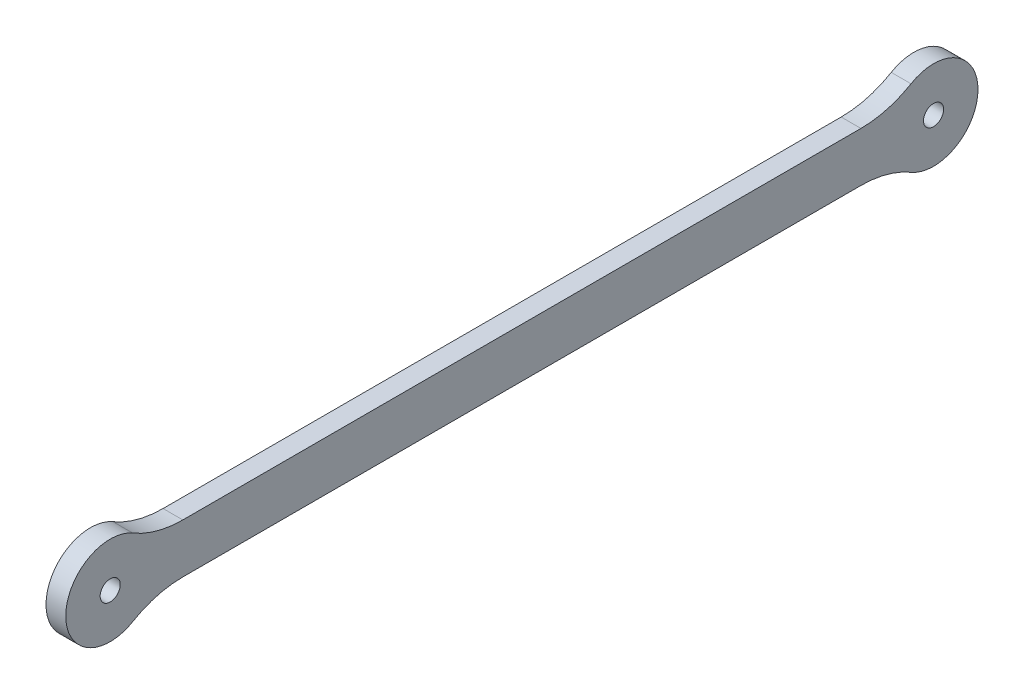
ISO-10303-21;
HEADER;
FILE_DESCRIPTION(('STEP AP214'),'2;1');
FILE_NAME('part.step','',(''),(''),'','','');
FILE_SCHEMA(('AUTOMOTIVE_DESIGN { 1 0 10303 214 1 1 1 1 }'));
ENDSEC;
DATA;
#1=APPLICATION_CONTEXT('core data for automotive mechanical design processes');
#2=APPLICATION_PROTOCOL_DEFINITION('international standard','automotive_design',2000,#1);
#3=PRODUCT_CONTEXT('',#1,'mechanical');
#4=PRODUCT('Part','Part','',(#3));
#5=PRODUCT_RELATED_PRODUCT_CATEGORY('part','',(#4));
#6=PRODUCT_DEFINITION_FORMATION('','',#4);
#7=PRODUCT_DEFINITION_CONTEXT('part definition',#1,'design');
#8=PRODUCT_DEFINITION('design','',#6,#7);
#9=PRODUCT_DEFINITION_SHAPE('','',#8);
#10=(LENGTH_UNIT() NAMED_UNIT(*) SI_UNIT(.MILLI.,.METRE.));
#11=(NAMED_UNIT(*) PLANE_ANGLE_UNIT() SI_UNIT($,.RADIAN.));
#12=(NAMED_UNIT(*) SI_UNIT($,.STERADIAN.) SOLID_ANGLE_UNIT());
#13=UNCERTAINTY_MEASURE_WITH_UNIT(LENGTH_MEASURE(1.E-05),#10,'distance_accuracy_value','');
#14=(GEOMETRIC_REPRESENTATION_CONTEXT(3) GLOBAL_UNCERTAINTY_ASSIGNED_CONTEXT((#13)) GLOBAL_UNIT_ASSIGNED_CONTEXT((#10,
#11,#12)) REPRESENTATION_CONTEXT('',''));
#15=CARTESIAN_POINT('',(0.,0.,0.));
#16=DIRECTION('',(0.,0.,1.));
#17=DIRECTION('',(1.,0.,0.));
#18=AXIS2_PLACEMENT_3D('',#15,#16,#17);
#19=CARTESIAN_POINT('',(1.5,0.,0.));
#20=DIRECTION('',(1.,0.,0.));
#21=DIRECTION('',(0.,0.,-1.));
#22=AXIS2_PLACEMENT_3D('',#19,#20,#21);
#23=PLANE('',#22);
#24=CARTESIAN_POINT('',(1.5,0.,-62.5));
#25=DIRECTION('',(-1.,0.,0.));
#26=DIRECTION('',(0.,0.,1.));
#27=AXIS2_PLACEMENT_3D('',#24,#25,#26);
#28=CIRCLE('',#27,1.52500000000001);
#29=CARTESIAN_POINT('',(1.5,0.,-60.975));
#30=VERTEX_POINT('',#29);
#31=EDGE_CURVE('E96',#30,#30,#28,.T.);
#32=ORIENTED_EDGE('',*,*,#31,.T.);
#33=EDGE_LOOP('',(#32));
#34=FACE_BOUND('',#33,.T.);
#35=CARTESIAN_POINT('',(1.5,0.,62.5));
#36=DIRECTION('',(-1.,0.,0.));
#37=DIRECTION('',(0.,0.,1.));
#38=AXIS2_PLACEMENT_3D('',#35,#36,#37);
#39=CIRCLE('',#38,1.52499999999999);
#40=CARTESIAN_POINT('',(1.5,0.,64.025));
#41=VERTEX_POINT('',#40);
#42=EDGE_CURVE('E93',#41,#41,#39,.T.);
#43=ORIENTED_EDGE('',*,*,#42,.T.);
#44=EDGE_LOOP('',(#43));
#45=FACE_BOUND('',#44,.T.);
#46=DIRECTION('',(0.,0.,-1.));
#47=VECTOR('',#46,1.);
#48=CARTESIAN_POINT('',(1.5,-3.75,0.));
#49=LINE('',#48,#47);
#50=CARTESIAN_POINT('',(1.5,-3.74999999999999,-51.4772961574757));
#51=VERTEX_POINT('',#50);
#52=CARTESIAN_POINT('',(1.5,-3.75000000000001,51.4772961574757));
#53=VERTEX_POINT('',#52);
#54=EDGE_CURVE('E102',#51,#53,#49,.F.);
#55=ORIENTED_EDGE('',*,*,#54,.F.);
#56=CARTESIAN_POINT('',(1.5,-18.75,-51.4772961574757));
#57=DIRECTION('',(-1.,0.,0.));
#58=DIRECTION('',(0.,0.,1.));
#59=AXIS2_PLACEMENT_3D('',#56,#57,#58);
#60=CIRCLE('',#59,15.);
#61=CARTESIAN_POINT('',(1.5,-5.81896551724137,-59.079160876458));
#62=VERTEX_POINT('',#61);
#63=EDGE_CURVE('E132',#51,#62,#60,.T.);
#64=ORIENTED_EDGE('',*,*,#63,.T.);
#65=CARTESIAN_POINT('',(1.5,0.,-62.5));
#66=DIRECTION('',(-1.,0.,0.));
#67=DIRECTION('',(0.,0.,1.));
#68=AXIS2_PLACEMENT_3D('',#65,#66,#67);
#69=CIRCLE('',#68,6.74999999999999);
#70=CARTESIAN_POINT('',(1.5,5.81896551724138,-59.079160876458));
#71=VERTEX_POINT('',#70);
#72=EDGE_CURVE('E129',#71,#62,#69,.T.);
#73=ORIENTED_EDGE('',*,*,#72,.F.);
#74=CARTESIAN_POINT('',(1.5,18.75,-51.4772961574757));
#75=DIRECTION('',(-1.,0.,0.));
#76=DIRECTION('',(0.,0.,1.));
#77=AXIS2_PLACEMENT_3D('',#74,#75,#76);
#78=CIRCLE('',#77,15.);
#79=CARTESIAN_POINT('',(1.5,3.75000000000001,-51.4772961574757));
#80=VERTEX_POINT('',#79);
#81=EDGE_CURVE('E90',#71,#80,#78,.T.);
#82=ORIENTED_EDGE('',*,*,#81,.T.);
#83=DIRECTION('',(0.,0.,-1.));
#84=VECTOR('',#83,1.);
#85=CARTESIAN_POINT('',(1.5,3.75,0.));
#86=LINE('',#85,#84);
#87=CARTESIAN_POINT('',(1.5,3.74999999999999,51.4772961574757));
#88=VERTEX_POINT('',#87);
#89=EDGE_CURVE('E88',#80,#88,#86,.F.);
#90=ORIENTED_EDGE('',*,*,#89,.T.);
#91=CARTESIAN_POINT('',(1.5,18.75,51.4772961574757));
#92=DIRECTION('',(-1.,0.,0.));
#93=DIRECTION('',(0.,0.,1.));
#94=AXIS2_PLACEMENT_3D('',#91,#92,#93);
#95=CIRCLE('',#94,15.);
#96=CARTESIAN_POINT('',(1.5,5.81896551724137,59.079160876458));
#97=VERTEX_POINT('',#96);
#98=EDGE_CURVE('E19',#88,#97,#95,.T.);
#99=ORIENTED_EDGE('',*,*,#98,.T.);
#100=CARTESIAN_POINT('',(1.5,0.,62.5));
#101=DIRECTION('',(-1.,0.,0.));
#102=DIRECTION('',(0.,0.,1.));
#103=AXIS2_PLACEMENT_3D('',#100,#101,#102);
#104=CIRCLE('',#103,6.75);
#105=CARTESIAN_POINT('',(1.5,-5.81896551724139,59.079160876458));
#106=VERTEX_POINT('',#105);
#107=EDGE_CURVE('E138',#106,#97,#104,.T.);
#108=ORIENTED_EDGE('',*,*,#107,.F.);
#109=CARTESIAN_POINT('',(1.5,-18.75,51.4772961574757));
#110=DIRECTION('',(-1.,0.,0.));
#111=DIRECTION('',(0.,0.,1.));
#112=AXIS2_PLACEMENT_3D('',#109,#110,#111);
#113=CIRCLE('',#112,15.);
#114=EDGE_CURVE('E104',#106,#53,#113,.T.);
#115=ORIENTED_EDGE('',*,*,#114,.T.);
#116=EDGE_LOOP('',(#55,#64,#73,#82,#90,#99,#108,#115));
#117=FACE_BOUND('',#116,.T.);
#118=ADVANCED_FACE('F16',(#34,#45,#117),#23,.T.);
#119=CARTESIAN_POINT('',(1.5,18.75,51.4772961574757));
#120=DIRECTION('',(-1.,0.,0.));
#121=DIRECTION('',(0.,0.,1.));
#122=AXIS2_PLACEMENT_3D('',#119,#120,#121);
#123=CYLINDRICAL_SURFACE('',#122,15.);
#124=DIRECTION('',(1.,0.,0.));
#125=VECTOR('',#124,1.);
#126=CARTESIAN_POINT('',(1.5,3.74999999999999,51.4772961574757));
#127=LINE('',#126,#125);
#128=CARTESIAN_POINT('',(-1.5,3.75,51.4772961574757));
#129=VERTEX_POINT('',#128);
#130=EDGE_CURVE('E83',#88,#129,#127,.F.);
#131=ORIENTED_EDGE('',*,*,#130,.T.);
#132=CARTESIAN_POINT('',(-1.5,18.75,51.4772961574757));
#133=DIRECTION('',(-1.,0.,0.));
#134=DIRECTION('',(0.,0.,1.));
#135=AXIS2_PLACEMENT_3D('',#132,#133,#134);
#136=CIRCLE('',#135,15.);
#137=CARTESIAN_POINT('',(-1.5,5.81896551724137,59.079160876458));
#138=VERTEX_POINT('',#137);
#139=EDGE_CURVE('E123',#129,#138,#136,.T.);
#140=ORIENTED_EDGE('',*,*,#139,.T.);
#141=DIRECTION('',(-1.,0.,0.));
#142=VECTOR('',#141,1.);
#143=CARTESIAN_POINT('',(1.5,5.81896551724137,59.079160876458));
#144=LINE('',#143,#142);
#145=EDGE_CURVE('E84',#97,#138,#144,.T.);
#146=ORIENTED_EDGE('',*,*,#145,.F.);
#147=ORIENTED_EDGE('',*,*,#98,.F.);
#148=EDGE_LOOP('',(#131,#140,#146,#147));
#149=FACE_BOUND('',#148,.T.);
#150=ADVANCED_FACE('F81',(#149),#123,.F.);
#151=CARTESIAN_POINT('',(1.5,0.,62.5));
#152=DIRECTION('',(-1.,0.,0.));
#153=DIRECTION('',(0.,0.,1.));
#154=AXIS2_PLACEMENT_3D('',#151,#152,#153);
#155=CYLINDRICAL_SURFACE('',#154,6.75);
#156=CARTESIAN_POINT('',(-1.5,0.,62.5));
#157=DIRECTION('',(-1.,0.,0.));
#158=DIRECTION('',(0.,0.,1.));
#159=AXIS2_PLACEMENT_3D('',#156,#157,#158);
#160=CIRCLE('',#159,6.75);
#161=CARTESIAN_POINT('',(-1.5,-5.81896551724139,59.079160876458));
#162=VERTEX_POINT('',#161);
#163=EDGE_CURVE('E121',#138,#162,#160,.F.);
#164=ORIENTED_EDGE('',*,*,#163,.T.);
#165=DIRECTION('',(-1.,0.,0.));
#166=VECTOR('',#165,1.);
#167=CARTESIAN_POINT('',(1.5,-5.81896551724139,59.079160876458));
#168=LINE('',#167,#166);
#169=EDGE_CURVE('E137',#162,#106,#168,.F.);
#170=ORIENTED_EDGE('',*,*,#169,.T.);
#171=ORIENTED_EDGE('',*,*,#107,.T.);
#172=ORIENTED_EDGE('',*,*,#145,.T.);
#173=EDGE_LOOP('',(#164,#170,#171,#172));
#174=FACE_BOUND('',#173,.T.);
#175=ADVANCED_FACE('F143',(#174),#155,.T.);
#176=CARTESIAN_POINT('',(1.5,-18.75,51.4772961574757));
#177=DIRECTION('',(-1.,0.,0.));
#178=DIRECTION('',(0.,0.,1.));
#179=AXIS2_PLACEMENT_3D('',#176,#177,#178);
#180=CYLINDRICAL_SURFACE('',#179,15.);
#181=ORIENTED_EDGE('',*,*,#169,.F.);
#182=CARTESIAN_POINT('',(-1.5,-18.75,51.4772961574757));
#183=DIRECTION('',(-1.,0.,0.));
#184=DIRECTION('',(0.,0.,1.));
#185=AXIS2_PLACEMENT_3D('',#182,#183,#184);
#186=CIRCLE('',#185,15.);
#187=CARTESIAN_POINT('',(-1.5,-3.75000000000001,51.4772961574757));
#188=VERTEX_POINT('',#187);
#189=EDGE_CURVE('E118',#162,#188,#186,.T.);
#190=ORIENTED_EDGE('',*,*,#189,.T.);
#191=DIRECTION('',(1.,0.,0.));
#192=VECTOR('',#191,1.);
#193=CARTESIAN_POINT('',(1.5,-3.75000000000001,51.4772961574757));
#194=LINE('',#193,#192);
#195=EDGE_CURVE('E103',#53,#188,#194,.F.);
#196=ORIENTED_EDGE('',*,*,#195,.F.);
#197=ORIENTED_EDGE('',*,*,#114,.F.);
#198=EDGE_LOOP('',(#181,#190,#196,#197));
#199=FACE_BOUND('',#198,.T.);
#200=ADVANCED_FACE('F154',(#199),#180,.F.);
#201=CARTESIAN_POINT('',(1.5,-3.75,0.));
#202=DIRECTION('',(0.,-1.,0.));
#203=DIRECTION('',(0.,0.,-1.));
#204=AXIS2_PLACEMENT_3D('',#201,#202,#203);
#205=PLANE('',#204);
#206=ORIENTED_EDGE('',*,*,#54,.T.);
#207=ORIENTED_EDGE('',*,*,#195,.T.);
#208=DIRECTION('',(0.,0.,-1.));
#209=VECTOR('',#208,1.);
#210=CARTESIAN_POINT('',(-1.5,-3.75000000000001,0.));
#211=LINE('',#210,#209);
#212=CARTESIAN_POINT('',(-1.5,-3.75,-51.4772961574757));
#213=VERTEX_POINT('',#212);
#214=EDGE_CURVE('E117',#188,#213,#211,.T.);
#215=ORIENTED_EDGE('',*,*,#214,.T.);
#216=DIRECTION('',(-1.,0.,0.));
#217=VECTOR('',#216,1.);
#218=CARTESIAN_POINT('',(1.5,-3.74999999999999,-51.4772961574757));
#219=LINE('',#218,#217);
#220=EDGE_CURVE('E135',#213,#51,#219,.F.);
#221=ORIENTED_EDGE('',*,*,#220,.T.);
#222=EDGE_LOOP('',(#206,#207,#215,#221));
#223=FACE_BOUND('',#222,.T.);
#224=ADVANCED_FACE('F162',(#223),#205,.T.);
#225=CARTESIAN_POINT('',(1.5,-18.75,-51.4772961574757));
#226=DIRECTION('',(-1.,0.,0.));
#227=DIRECTION('',(0.,0.,1.));
#228=AXIS2_PLACEMENT_3D('',#225,#226,#227);
#229=CYLINDRICAL_SURFACE('',#228,15.);
#230=ORIENTED_EDGE('',*,*,#220,.F.);
#231=CARTESIAN_POINT('',(-1.5,-18.75,-51.4772961574757));
#232=DIRECTION('',(-1.,0.,0.));
#233=DIRECTION('',(0.,0.,1.));
#234=AXIS2_PLACEMENT_3D('',#231,#232,#233);
#235=CIRCLE('',#234,15.);
#236=CARTESIAN_POINT('',(-1.5,-5.81896551724137,-59.079160876458));
#237=VERTEX_POINT('',#236);
#238=EDGE_CURVE('E114',#213,#237,#235,.T.);
#239=ORIENTED_EDGE('',*,*,#238,.T.);
#240=DIRECTION('',(-1.,0.,0.));
#241=VECTOR('',#240,1.);
#242=CARTESIAN_POINT('',(1.5,-5.81896551724137,-59.079160876458));
#243=LINE('',#242,#241);
#244=EDGE_CURVE('E131',#62,#237,#243,.T.);
#245=ORIENTED_EDGE('',*,*,#244,.F.);
#246=ORIENTED_EDGE('',*,*,#63,.F.);
#247=EDGE_LOOP('',(#230,#239,#245,#246));
#248=FACE_BOUND('',#247,.T.);
#249=ADVANCED_FACE('F161',(#248),#229,.F.);
#250=CARTESIAN_POINT('',(1.5,0.,-62.5));
#251=DIRECTION('',(-1.,0.,0.));
#252=DIRECTION('',(0.,0.,1.));
#253=AXIS2_PLACEMENT_3D('',#250,#251,#252);
#254=CYLINDRICAL_SURFACE('',#253,6.74999999999999);
#255=ORIENTED_EDGE('',*,*,#72,.T.);
#256=ORIENTED_EDGE('',*,*,#244,.T.);
#257=CARTESIAN_POINT('',(-1.5,0.,-62.5));
#258=DIRECTION('',(-1.,0.,0.));
#259=DIRECTION('',(0.,0.,1.));
#260=AXIS2_PLACEMENT_3D('',#257,#258,#259);
#261=CIRCLE('',#260,6.74999999999999);
#262=CARTESIAN_POINT('',(-1.5,5.81896551724138,-59.079160876458));
#263=VERTEX_POINT('',#262);
#264=EDGE_CURVE('E111',#237,#263,#261,.F.);
#265=ORIENTED_EDGE('',*,*,#264,.T.);
#266=DIRECTION('',(-1.,0.,0.));
#267=VECTOR('',#266,1.);
#268=CARTESIAN_POINT('',(1.5,5.81896551724138,-59.079160876458));
#269=LINE('',#268,#267);
#270=EDGE_CURVE('E128',#263,#71,#269,.F.);
#271=ORIENTED_EDGE('',*,*,#270,.T.);
#272=EDGE_LOOP('',(#255,#256,#265,#271));
#273=FACE_BOUND('',#272,.T.);
#274=ADVANCED_FACE('F171',(#273),#254,.T.);
#275=CARTESIAN_POINT('',(1.5,18.75,-51.4772961574757));
#276=DIRECTION('',(-1.,0.,0.));
#277=DIRECTION('',(0.,0.,1.));
#278=AXIS2_PLACEMENT_3D('',#275,#276,#277);
#279=CYLINDRICAL_SURFACE('',#278,15.);
#280=ORIENTED_EDGE('',*,*,#270,.F.);
#281=CARTESIAN_POINT('',(-1.5,18.75,-51.4772961574757));
#282=DIRECTION('',(-1.,0.,0.));
#283=DIRECTION('',(0.,0.,1.));
#284=AXIS2_PLACEMENT_3D('',#281,#282,#283);
#285=CIRCLE('',#284,15.);
#286=CARTESIAN_POINT('',(-1.5,3.75000000000001,-51.4772961574757));
#287=VERTEX_POINT('',#286);
#288=EDGE_CURVE('E108',#263,#287,#285,.T.);
#289=ORIENTED_EDGE('',*,*,#288,.T.);
#290=DIRECTION('',(1.,0.,0.));
#291=VECTOR('',#290,1.);
#292=CARTESIAN_POINT('',(1.5,3.75000000000001,-51.4772961574757));
#293=LINE('',#292,#291);
#294=EDGE_CURVE('E34',#287,#80,#293,.T.);
#295=ORIENTED_EDGE('',*,*,#294,.T.);
#296=ORIENTED_EDGE('',*,*,#81,.F.);
#297=EDGE_LOOP('',(#280,#289,#295,#296));
#298=FACE_BOUND('',#297,.T.);
#299=ADVANCED_FACE('F174',(#298),#279,.F.);
#300=CARTESIAN_POINT('',(1.5,3.75,0.));
#301=DIRECTION('',(0.,-1.,0.));
#302=DIRECTION('',(0.,0.,-1.));
#303=AXIS2_PLACEMENT_3D('',#300,#301,#302);
#304=PLANE('',#303);
#305=ORIENTED_EDGE('',*,*,#294,.F.);
#306=DIRECTION('',(0.,0.,-1.));
#307=VECTOR('',#306,1.);
#308=CARTESIAN_POINT('',(-1.5,3.75000000000001,0.));
#309=LINE('',#308,#307);
#310=EDGE_CURVE('E89',#287,#129,#309,.F.);
#311=ORIENTED_EDGE('',*,*,#310,.T.);
#312=ORIENTED_EDGE('',*,*,#130,.F.);
#313=ORIENTED_EDGE('',*,*,#89,.F.);
#314=EDGE_LOOP('',(#305,#311,#312,#313));
#315=FACE_BOUND('',#314,.T.);
#316=ADVANCED_FACE('F87',(#315),#304,.F.);
#317=CARTESIAN_POINT('',(1.5,0.,62.5));
#318=DIRECTION('',(-1.,0.,0.));
#319=DIRECTION('',(0.,0.,1.));
#320=AXIS2_PLACEMENT_3D('',#317,#318,#319);
#321=CYLINDRICAL_SURFACE('',#320,1.52499999999999);
#322=CARTESIAN_POINT('',(-1.5,0.,62.5));
#323=DIRECTION('',(-1.,0.,0.));
#324=DIRECTION('',(0.,0.,1.));
#325=AXIS2_PLACEMENT_3D('',#322,#323,#324);
#326=CIRCLE('',#325,1.52499999999999);
#327=CARTESIAN_POINT('',(-1.5,0.,64.025));
#328=VERTEX_POINT('',#327);
#329=EDGE_CURVE('E25',#328,#328,#326,.T.);
#330=ORIENTED_EDGE('',*,*,#329,.T.);
#331=EDGE_LOOP('',(#330));
#332=FACE_BOUND('',#331,.T.);
#333=ORIENTED_EDGE('',*,*,#42,.F.);
#334=EDGE_LOOP('',(#333));
#335=FACE_BOUND('',#334,.T.);
#336=ADVANCED_FACE('F182',(#332,#335),#321,.F.);
#337=CARTESIAN_POINT('',(1.5,0.,-62.5));
#338=DIRECTION('',(-1.,0.,0.));
#339=DIRECTION('',(0.,0.,1.));
#340=AXIS2_PLACEMENT_3D('',#337,#338,#339);
#341=CYLINDRICAL_SURFACE('',#340,1.52500000000001);
#342=CARTESIAN_POINT('',(-1.5,0.,-62.5));
#343=DIRECTION('',(-1.,0.,0.));
#344=DIRECTION('',(0.,0.,1.));
#345=AXIS2_PLACEMENT_3D('',#342,#343,#344);
#346=CIRCLE('',#345,1.52500000000001);
#347=CARTESIAN_POINT('',(-1.5,0.,-60.975));
#348=VERTEX_POINT('',#347);
#349=EDGE_CURVE('E11',#348,#348,#346,.T.);
#350=ORIENTED_EDGE('',*,*,#349,.T.);
#351=EDGE_LOOP('',(#350));
#352=FACE_BOUND('',#351,.T.);
#353=ORIENTED_EDGE('',*,*,#31,.F.);
#354=EDGE_LOOP('',(#353));
#355=FACE_BOUND('',#354,.T.);
#356=ADVANCED_FACE('F186',(#352,#355),#341,.F.);
#357=CARTESIAN_POINT('',(-1.5,0.,0.));
#358=DIRECTION('',(1.,0.,0.));
#359=DIRECTION('',(0.,0.,-1.));
#360=AXIS2_PLACEMENT_3D('',#357,#358,#359);
#361=PLANE('',#360);
#362=ORIENTED_EDGE('',*,*,#349,.F.);
#363=EDGE_LOOP('',(#362));
#364=FACE_BOUND('',#363,.T.);
#365=ORIENTED_EDGE('',*,*,#329,.F.);
#366=EDGE_LOOP('',(#365));
#367=FACE_BOUND('',#366,.T.);
#368=ORIENTED_EDGE('',*,*,#288,.F.);
#369=ORIENTED_EDGE('',*,*,#264,.F.);
#370=ORIENTED_EDGE('',*,*,#238,.F.);
#371=ORIENTED_EDGE('',*,*,#214,.F.);
#372=ORIENTED_EDGE('',*,*,#189,.F.);
#373=ORIENTED_EDGE('',*,*,#163,.F.);
#374=ORIENTED_EDGE('',*,*,#139,.F.);
#375=ORIENTED_EDGE('',*,*,#310,.F.);
#376=EDGE_LOOP('',(#368,#369,#370,#371,#372,#373,#374,#375));
#377=FACE_BOUND('',#376,.T.);
#378=ADVANCED_FACE('F148',(#364,#367,#377),#361,.F.);
#379=CLOSED_SHELL('',(#118,#150,#175,#200,#224,#249,#274,#299,#316,#336,#356,#378));
#380=MANIFOLD_SOLID_BREP('B1',#379);
#381=ADVANCED_BREP_SHAPE_REPRESENTATION('',(#18,#380),#14);
#382=SHAPE_DEFINITION_REPRESENTATION(#9,#381);
ENDSEC;
END-ISO-10303-21;
